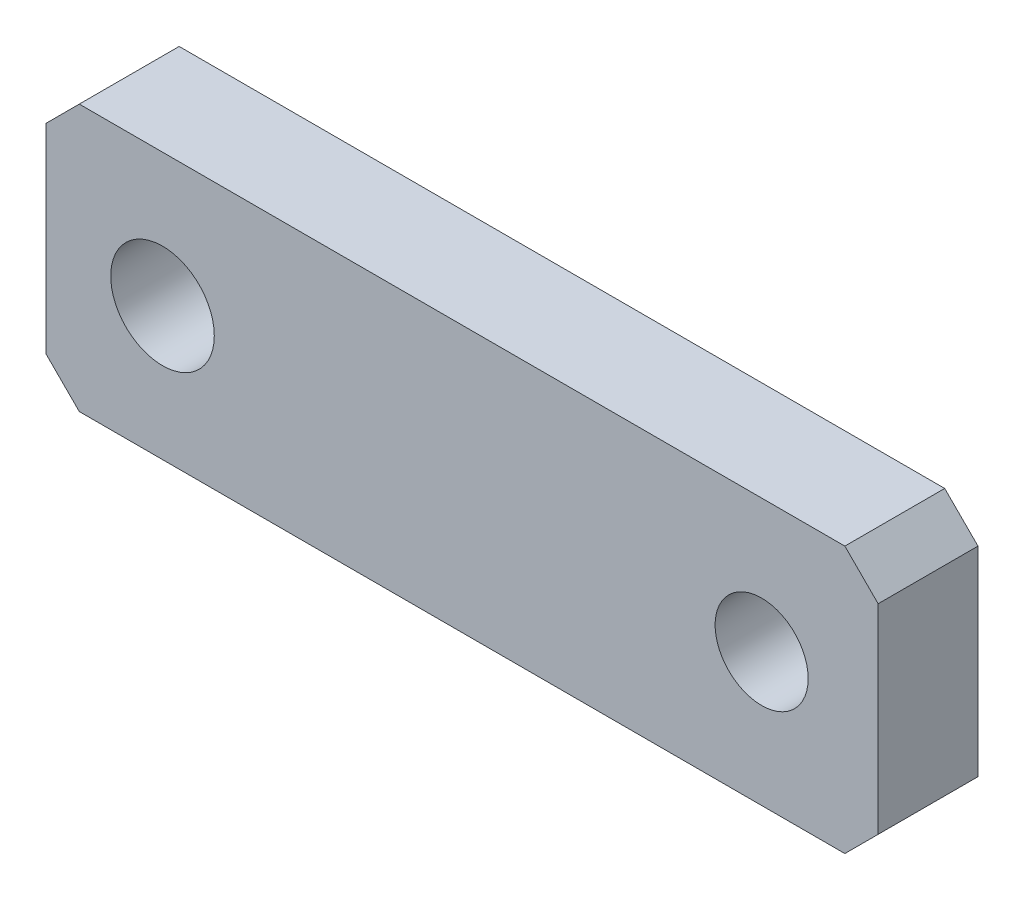
ISO-10303-21;
HEADER;
FILE_DESCRIPTION(('STEP AP214'),'2;1');
FILE_NAME('part.step','',(''),(''),'','','');
FILE_SCHEMA(('AUTOMOTIVE_DESIGN { 1 0 10303 214 1 1 1 1 }'));
ENDSEC;
DATA;
#1=APPLICATION_CONTEXT('core data for automotive mechanical design processes');
#2=APPLICATION_PROTOCOL_DEFINITION('international standard','automotive_design',2000,#1);
#3=PRODUCT_CONTEXT('',#1,'mechanical');
#4=PRODUCT('Part','Part','',(#3));
#5=PRODUCT_RELATED_PRODUCT_CATEGORY('part','',(#4));
#6=PRODUCT_DEFINITION_FORMATION('','',#4);
#7=PRODUCT_DEFINITION_CONTEXT('part definition',#1,'design');
#8=PRODUCT_DEFINITION('design','',#6,#7);
#9=PRODUCT_DEFINITION_SHAPE('','',#8);
#10=(LENGTH_UNIT() NAMED_UNIT(*) SI_UNIT(.MILLI.,.METRE.));
#11=(NAMED_UNIT(*) PLANE_ANGLE_UNIT() SI_UNIT($,.RADIAN.));
#12=(NAMED_UNIT(*) SI_UNIT($,.STERADIAN.) SOLID_ANGLE_UNIT());
#13=UNCERTAINTY_MEASURE_WITH_UNIT(LENGTH_MEASURE(1.E-05),#10,'distance_accuracy_value','');
#14=(GEOMETRIC_REPRESENTATION_CONTEXT(3) GLOBAL_UNCERTAINTY_ASSIGNED_CONTEXT((#13)) GLOBAL_UNIT_ASSIGNED_CONTEXT((#10,
#11,#12)) REPRESENTATION_CONTEXT('',''));
#15=CARTESIAN_POINT('',(0.,0.,0.));
#16=DIRECTION('',(0.,0.,1.));
#17=DIRECTION('',(1.,0.,0.));
#18=AXIS2_PLACEMENT_3D('',#15,#16,#17);
#19=CARTESIAN_POINT('',(0.,0.,6.));
#20=DIRECTION('',(0.,0.,1.));
#21=DIRECTION('',(1.,0.,0.));
#22=AXIS2_PLACEMENT_3D('',#19,#20,#21);
#23=PLANE('',#22);
#24=CARTESIAN_POINT('',(-18.,0.,6.));
#25=DIRECTION('',(0.,0.,1.));
#26=DIRECTION('',(1.,0.,0.));
#27=AXIS2_PLACEMENT_3D('',#24,#25,#26);
#28=CIRCLE('',#27,3.11242015711075);
#29=CARTESIAN_POINT('',(-14.8875798428893,0.,6.));
#30=VERTEX_POINT('',#29);
#31=EDGE_CURVE('E164',#30,#30,#28,.T.);
#32=ORIENTED_EDGE('',*,*,#31,.F.);
#33=EDGE_LOOP('',(#32));
#34=FACE_BOUND('',#33,.T.);
#35=DIRECTION('',(0.,-1.,0.));
#36=VECTOR('',#35,1.);
#37=CARTESIAN_POINT('',(-25.,8.,6.));
#38=LINE('',#37,#36);
#39=CARTESIAN_POINT('',(-25.,6.,6.));
#40=VERTEX_POINT('',#39);
#41=CARTESIAN_POINT('',(-25.,-5.99999999999999,6.));
#42=VERTEX_POINT('',#41);
#43=EDGE_CURVE('E171',#40,#42,#38,.T.);
#44=ORIENTED_EDGE('',*,*,#43,.T.);
#45=DIRECTION('',(-0.707106781186546,0.707106781186549,0.));
#46=VECTOR('',#45,1.);
#47=CARTESIAN_POINT('',(-15.5,-15.5,6.));
#48=LINE('',#47,#46);
#49=CARTESIAN_POINT('',(-23.,-8.,6.));
#50=VERTEX_POINT('',#49);
#51=EDGE_CURVE('E148',#42,#50,#48,.F.);
#52=ORIENTED_EDGE('',*,*,#51,.T.);
#53=DIRECTION('',(1.,0.,0.));
#54=VECTOR('',#53,1.);
#55=CARTESIAN_POINT('',(-25.,-8.,6.));
#56=LINE('',#55,#54);
#57=CARTESIAN_POINT('',(23.,-8.,6.));
#58=VERTEX_POINT('',#57);
#59=EDGE_CURVE('E119',#50,#58,#56,.T.);
#60=ORIENTED_EDGE('',*,*,#59,.T.);
#61=DIRECTION('',(-0.707106781186548,-0.707106781186547,0.));
#62=VECTOR('',#61,1.);
#63=CARTESIAN_POINT('',(15.5,-15.5,6.));
#64=LINE('',#63,#62);
#65=CARTESIAN_POINT('',(25.,-6.00000000000001,6.));
#66=VERTEX_POINT('',#65);
#67=EDGE_CURVE('E146',#58,#66,#64,.F.);
#68=ORIENTED_EDGE('',*,*,#67,.T.);
#69=DIRECTION('',(0.,1.,0.));
#70=VECTOR('',#69,1.);
#71=CARTESIAN_POINT('',(25.,8.,6.));
#72=LINE('',#71,#70);
#73=CARTESIAN_POINT('',(25.,6.,6.));
#74=VERTEX_POINT('',#73);
#75=EDGE_CURVE('E126',#66,#74,#72,.T.);
#76=ORIENTED_EDGE('',*,*,#75,.T.);
#77=DIRECTION('',(0.707106781186546,-0.707106781186549,0.));
#78=VECTOR('',#77,1.);
#79=CARTESIAN_POINT('',(15.5,15.5,6.));
#80=LINE('',#79,#78);
#81=CARTESIAN_POINT('',(23.,8.,6.));
#82=VERTEX_POINT('',#81);
#83=EDGE_CURVE('E54',#74,#82,#80,.F.);
#84=ORIENTED_EDGE('',*,*,#83,.T.);
#85=DIRECTION('',(-1.,0.,0.));
#86=VECTOR('',#85,1.);
#87=CARTESIAN_POINT('',(-25.,8.,6.));
#88=LINE('',#87,#86);
#89=CARTESIAN_POINT('',(-23.,8.,6.));
#90=VERTEX_POINT('',#89);
#91=EDGE_CURVE('E129',#82,#90,#88,.T.);
#92=ORIENTED_EDGE('',*,*,#91,.T.);
#93=DIRECTION('',(0.70710678118655,0.707106781186545,0.));
#94=VECTOR('',#93,1.);
#95=CARTESIAN_POINT('',(-15.4999999999999,15.5,6.));
#96=LINE('',#95,#94);
#97=EDGE_CURVE('E143',#90,#40,#96,.F.);
#98=ORIENTED_EDGE('',*,*,#97,.T.);
#99=EDGE_LOOP('',(#44,#52,#60,#68,#76,#84,#92,#98));
#100=FACE_BOUND('',#99,.T.);
#101=CARTESIAN_POINT('',(18.,0.,6.));
#102=DIRECTION('',(0.,0.,1.));
#103=DIRECTION('',(1.,0.,0.));
#104=AXIS2_PLACEMENT_3D('',#101,#102,#103);
#105=CIRCLE('',#104,2.79516517862604);
#106=CARTESIAN_POINT('',(20.795165178626,0.,6.));
#107=VERTEX_POINT('',#106);
#108=EDGE_CURVE('E176',#107,#107,#105,.T.);
#109=ORIENTED_EDGE('',*,*,#108,.F.);
#110=EDGE_LOOP('',(#109));
#111=FACE_BOUND('',#110,.T.);
#112=ADVANCED_FACE('F33',(#34,#100,#111),#23,.T.);
#113=CARTESIAN_POINT('',(0.,0.,0.));
#114=DIRECTION('',(0.,0.,1.));
#115=DIRECTION('',(1.,0.,0.));
#116=AXIS2_PLACEMENT_3D('',#113,#114,#115);
#117=PLANE('',#116);
#118=DIRECTION('',(1.,0.,0.));
#119=VECTOR('',#118,1.);
#120=CARTESIAN_POINT('',(-25.,-8.,0.));
#121=LINE('',#120,#119);
#122=CARTESIAN_POINT('',(-23.,-8.,0.));
#123=VERTEX_POINT('',#122);
#124=CARTESIAN_POINT('',(23.,-8.,0.));
#125=VERTEX_POINT('',#124);
#126=EDGE_CURVE('E116',#123,#125,#121,.T.);
#127=ORIENTED_EDGE('',*,*,#126,.F.);
#128=DIRECTION('',(0.707106781186546,-0.707106781186549,0.));
#129=VECTOR('',#128,1.);
#130=CARTESIAN_POINT('',(-23.,-8.,0.));
#131=LINE('',#130,#129);
#132=CARTESIAN_POINT('',(-25.,-5.99999999999999,0.));
#133=VERTEX_POINT('',#132);
#134=EDGE_CURVE('E99',#123,#133,#131,.F.);
#135=ORIENTED_EDGE('',*,*,#134,.T.);
#136=DIRECTION('',(0.,-1.,0.));
#137=VECTOR('',#136,1.);
#138=CARTESIAN_POINT('',(-25.,8.,0.));
#139=LINE('',#138,#137);
#140=CARTESIAN_POINT('',(-25.,6.,0.));
#141=VERTEX_POINT('',#140);
#142=EDGE_CURVE('E127',#141,#133,#139,.T.);
#143=ORIENTED_EDGE('',*,*,#142,.F.);
#144=DIRECTION('',(-0.70710678118655,-0.707106781186545,0.));
#145=VECTOR('',#144,1.);
#146=CARTESIAN_POINT('',(-25.,5.99999999999999,0.));
#147=LINE('',#146,#145);
#148=CARTESIAN_POINT('',(-23.,8.,0.));
#149=VERTEX_POINT('',#148);
#150=EDGE_CURVE('E120',#141,#149,#147,.F.);
#151=ORIENTED_EDGE('',*,*,#150,.T.);
#152=DIRECTION('',(-1.,0.,0.));
#153=VECTOR('',#152,1.);
#154=CARTESIAN_POINT('',(-25.,8.,0.));
#155=LINE('',#154,#153);
#156=CARTESIAN_POINT('',(23.,8.,0.));
#157=VERTEX_POINT('',#156);
#158=EDGE_CURVE('E131',#157,#149,#155,.T.);
#159=ORIENTED_EDGE('',*,*,#158,.F.);
#160=DIRECTION('',(-0.707106781186546,0.707106781186549,0.));
#161=VECTOR('',#160,1.);
#162=CARTESIAN_POINT('',(23.,8.,0.));
#163=LINE('',#162,#161);
#164=CARTESIAN_POINT('',(25.,6.,0.));
#165=VERTEX_POINT('',#164);
#166=EDGE_CURVE('E137',#157,#165,#163,.F.);
#167=ORIENTED_EDGE('',*,*,#166,.T.);
#168=DIRECTION('',(0.,1.,0.));
#169=VECTOR('',#168,1.);
#170=CARTESIAN_POINT('',(25.,8.,0.));
#171=LINE('',#170,#169);
#172=CARTESIAN_POINT('',(25.,-6.00000000000001,0.));
#173=VERTEX_POINT('',#172);
#174=EDGE_CURVE('E159',#173,#165,#171,.T.);
#175=ORIENTED_EDGE('',*,*,#174,.F.);
#176=DIRECTION('',(0.707106781186548,0.707106781186547,0.));
#177=VECTOR('',#176,1.);
#178=CARTESIAN_POINT('',(25.,-6.00000000000001,0.));
#179=LINE('',#178,#177);
#180=EDGE_CURVE('E110',#173,#125,#179,.F.);
#181=ORIENTED_EDGE('',*,*,#180,.T.);
#182=EDGE_LOOP('',(#127,#135,#143,#151,#159,#167,#175,#181));
#183=FACE_BOUND('',#182,.T.);
#184=CARTESIAN_POINT('',(-18.,0.,0.));
#185=DIRECTION('',(0.,0.,1.));
#186=DIRECTION('',(1.,0.,0.));
#187=AXIS2_PLACEMENT_3D('',#184,#185,#186);
#188=CIRCLE('',#187,3.11242015711075);
#189=CARTESIAN_POINT('',(-14.8875798428893,0.,0.));
#190=VERTEX_POINT('',#189);
#191=EDGE_CURVE('E167',#190,#190,#188,.T.);
#192=ORIENTED_EDGE('',*,*,#191,.T.);
#193=EDGE_LOOP('',(#192));
#194=FACE_BOUND('',#193,.T.);
#195=CARTESIAN_POINT('',(18.,0.,0.));
#196=DIRECTION('',(0.,0.,1.));
#197=DIRECTION('',(1.,0.,0.));
#198=AXIS2_PLACEMENT_3D('',#195,#196,#197);
#199=CIRCLE('',#198,2.79516517862604);
#200=CARTESIAN_POINT('',(20.795165178626,0.,0.));
#201=VERTEX_POINT('',#200);
#202=EDGE_CURVE('E178',#201,#201,#199,.T.);
#203=ORIENTED_EDGE('',*,*,#202,.T.);
#204=EDGE_LOOP('',(#203));
#205=FACE_BOUND('',#204,.T.);
#206=ADVANCED_FACE('F123',(#183,#194,#205),#117,.F.);
#207=CARTESIAN_POINT('',(25.,8.,6.));
#208=DIRECTION('',(-1.,0.,0.));
#209=DIRECTION('',(0.,-1.,0.));
#210=AXIS2_PLACEMENT_3D('',#207,#208,#209);
#211=PLANE('',#210);
#212=ORIENTED_EDGE('',*,*,#75,.F.);
#213=DIRECTION('',(0.,0.,-1.));
#214=VECTOR('',#213,1.);
#215=CARTESIAN_POINT('',(25.,-6.00000000000001,6.));
#216=LINE('',#215,#214);
#217=EDGE_CURVE('E152',#66,#173,#216,.T.);
#218=ORIENTED_EDGE('',*,*,#217,.T.);
#219=ORIENTED_EDGE('',*,*,#174,.T.);
#220=DIRECTION('',(0.,0.,1.));
#221=VECTOR('',#220,1.);
#222=CARTESIAN_POINT('',(25.,6.,6.));
#223=LINE('',#222,#221);
#224=EDGE_CURVE('E150',#165,#74,#223,.T.);
#225=ORIENTED_EDGE('',*,*,#224,.T.);
#226=EDGE_LOOP('',(#212,#218,#219,#225));
#227=FACE_BOUND('',#226,.T.);
#228=ADVANCED_FACE('F158',(#227),#211,.F.);
#229=CARTESIAN_POINT('',(-25.,8.,6.));
#230=DIRECTION('',(0.,-1.,0.));
#231=DIRECTION('',(0.,0.,-1.));
#232=AXIS2_PLACEMENT_3D('',#229,#230,#231);
#233=PLANE('',#232);
#234=ORIENTED_EDGE('',*,*,#91,.F.);
#235=DIRECTION('',(0.,0.,-1.));
#236=VECTOR('',#235,1.);
#237=CARTESIAN_POINT('',(23.,8.,6.));
#238=LINE('',#237,#236);
#239=EDGE_CURVE('E11',#82,#157,#238,.T.);
#240=ORIENTED_EDGE('',*,*,#239,.T.);
#241=ORIENTED_EDGE('',*,*,#158,.T.);
#242=DIRECTION('',(0.,0.,1.));
#243=VECTOR('',#242,1.);
#244=CARTESIAN_POINT('',(-23.,8.,6.));
#245=LINE('',#244,#243);
#246=EDGE_CURVE('E41',#149,#90,#245,.T.);
#247=ORIENTED_EDGE('',*,*,#246,.T.);
#248=EDGE_LOOP('',(#234,#240,#241,#247));
#249=FACE_BOUND('',#248,.T.);
#250=ADVANCED_FACE('F204',(#249),#233,.F.);
#251=CARTESIAN_POINT('',(-25.,8.,6.));
#252=DIRECTION('',(1.,0.,0.));
#253=DIRECTION('',(0.,1.,0.));
#254=AXIS2_PLACEMENT_3D('',#251,#252,#253);
#255=PLANE('',#254);
#256=ORIENTED_EDGE('',*,*,#142,.T.);
#257=DIRECTION('',(0.,0.,1.));
#258=VECTOR('',#257,1.);
#259=CARTESIAN_POINT('',(-25.,-5.99999999999999,6.));
#260=LINE('',#259,#258);
#261=EDGE_CURVE('E104',#133,#42,#260,.T.);
#262=ORIENTED_EDGE('',*,*,#261,.T.);
#263=ORIENTED_EDGE('',*,*,#43,.F.);
#264=DIRECTION('',(0.,0.,-1.));
#265=VECTOR('',#264,1.);
#266=CARTESIAN_POINT('',(-25.,6.,6.));
#267=LINE('',#266,#265);
#268=EDGE_CURVE('E109',#40,#141,#267,.T.);
#269=ORIENTED_EDGE('',*,*,#268,.T.);
#270=EDGE_LOOP('',(#256,#262,#263,#269));
#271=FACE_BOUND('',#270,.T.);
#272=ADVANCED_FACE('F201',(#271),#255,.F.);
#273=CARTESIAN_POINT('',(-25.,-8.,6.));
#274=DIRECTION('',(0.,1.,0.));
#275=DIRECTION('',(0.,0.,1.));
#276=AXIS2_PLACEMENT_3D('',#273,#274,#275);
#277=PLANE('',#276);
#278=ORIENTED_EDGE('',*,*,#59,.F.);
#279=DIRECTION('',(0.,0.,-1.));
#280=VECTOR('',#279,1.);
#281=CARTESIAN_POINT('',(-23.,-8.,6.));
#282=LINE('',#281,#280);
#283=EDGE_CURVE('E103',#50,#123,#282,.T.);
#284=ORIENTED_EDGE('',*,*,#283,.T.);
#285=ORIENTED_EDGE('',*,*,#126,.T.);
#286=DIRECTION('',(0.,0.,1.));
#287=VECTOR('',#286,1.);
#288=CARTESIAN_POINT('',(23.,-8.,6.));
#289=LINE('',#288,#287);
#290=EDGE_CURVE('E121',#125,#58,#289,.T.);
#291=ORIENTED_EDGE('',*,*,#290,.T.);
#292=EDGE_LOOP('',(#278,#284,#285,#291));
#293=FACE_BOUND('',#292,.T.);
#294=ADVANCED_FACE('F115',(#293),#277,.F.);
#295=CARTESIAN_POINT('',(-18.,0.,6.));
#296=DIRECTION('',(0.,0.,-1.));
#297=DIRECTION('',(-1.,0.,0.));
#298=AXIS2_PLACEMENT_3D('',#295,#296,#297);
#299=CYLINDRICAL_SURFACE('',#298,3.11242015711075);
#300=ORIENTED_EDGE('',*,*,#31,.T.);
#301=EDGE_LOOP('',(#300));
#302=FACE_BOUND('',#301,.T.);
#303=ORIENTED_EDGE('',*,*,#191,.F.);
#304=EDGE_LOOP('',(#303));
#305=FACE_BOUND('',#304,.T.);
#306=ADVANCED_FACE('F196',(#302,#305),#299,.F.);
#307=CARTESIAN_POINT('',(18.,0.,6.));
#308=DIRECTION('',(0.,0.,-1.));
#309=DIRECTION('',(-1.,0.,0.));
#310=AXIS2_PLACEMENT_3D('',#307,#308,#309);
#311=CYLINDRICAL_SURFACE('',#310,2.79516517862604);
#312=ORIENTED_EDGE('',*,*,#108,.T.);
#313=EDGE_LOOP('',(#312));
#314=FACE_BOUND('',#313,.T.);
#315=ORIENTED_EDGE('',*,*,#202,.F.);
#316=EDGE_LOOP('',(#315));
#317=FACE_BOUND('',#316,.T.);
#318=ADVANCED_FACE('F184',(#314,#317),#311,.F.);
#319=CARTESIAN_POINT('',(-23.,-8.,6.));
#320=DIRECTION('',(0.707106781186549,0.707106781186546,0.));
#321=DIRECTION('',(0.,0.,-1.));
#322=AXIS2_PLACEMENT_3D('',#319,#320,#321);
#323=PLANE('',#322);
#324=ORIENTED_EDGE('',*,*,#51,.F.);
#325=ORIENTED_EDGE('',*,*,#261,.F.);
#326=ORIENTED_EDGE('',*,*,#134,.F.);
#327=ORIENTED_EDGE('',*,*,#283,.F.);
#328=EDGE_LOOP('',(#324,#325,#326,#327));
#329=FACE_BOUND('',#328,.T.);
#330=ADVANCED_FACE('F102',(#329),#323,.F.);
#331=CARTESIAN_POINT('',(25.,-6.00000000000001,6.));
#332=DIRECTION('',(-0.707106781186547,0.707106781186548,0.));
#333=DIRECTION('',(0.,0.,-1.));
#334=AXIS2_PLACEMENT_3D('',#331,#332,#333);
#335=PLANE('',#334);
#336=ORIENTED_EDGE('',*,*,#67,.F.);
#337=ORIENTED_EDGE('',*,*,#290,.F.);
#338=ORIENTED_EDGE('',*,*,#180,.F.);
#339=ORIENTED_EDGE('',*,*,#217,.F.);
#340=EDGE_LOOP('',(#336,#337,#338,#339));
#341=FACE_BOUND('',#340,.T.);
#342=ADVANCED_FACE('F212',(#341),#335,.F.);
#343=CARTESIAN_POINT('',(23.,8.,6.));
#344=DIRECTION('',(-0.707106781186549,-0.707106781186546,0.));
#345=DIRECTION('',(0.,0.,-1.));
#346=AXIS2_PLACEMENT_3D('',#343,#344,#345);
#347=PLANE('',#346);
#348=ORIENTED_EDGE('',*,*,#83,.F.);
#349=ORIENTED_EDGE('',*,*,#224,.F.);
#350=ORIENTED_EDGE('',*,*,#166,.F.);
#351=ORIENTED_EDGE('',*,*,#239,.F.);
#352=EDGE_LOOP('',(#348,#349,#350,#351));
#353=FACE_BOUND('',#352,.T.);
#354=ADVANCED_FACE('F214',(#353),#347,.F.);
#355=CARTESIAN_POINT('',(-25.,5.99999999999999,6.));
#356=DIRECTION('',(0.707106781186545,-0.70710678118655,0.));
#357=DIRECTION('',(0.,0.,-1.));
#358=AXIS2_PLACEMENT_3D('',#355,#356,#357);
#359=PLANE('',#358);
#360=ORIENTED_EDGE('',*,*,#97,.F.);
#361=ORIENTED_EDGE('',*,*,#246,.F.);
#362=ORIENTED_EDGE('',*,*,#150,.F.);
#363=ORIENTED_EDGE('',*,*,#268,.F.);
#364=EDGE_LOOP('',(#360,#361,#362,#363));
#365=FACE_BOUND('',#364,.T.);
#366=ADVANCED_FACE('F35',(#365),#359,.F.);
#367=CLOSED_SHELL('',(#112,#206,#228,#250,#272,#294,#306,#318,#330,#342,#354,#366));
#368=MANIFOLD_SOLID_BREP('B2',#367);
#369=ADVANCED_BREP_SHAPE_REPRESENTATION('',(#18,#368),#14);
#370=SHAPE_DEFINITION_REPRESENTATION(#9,#369);
ENDSEC;
END-ISO-10303-21;
